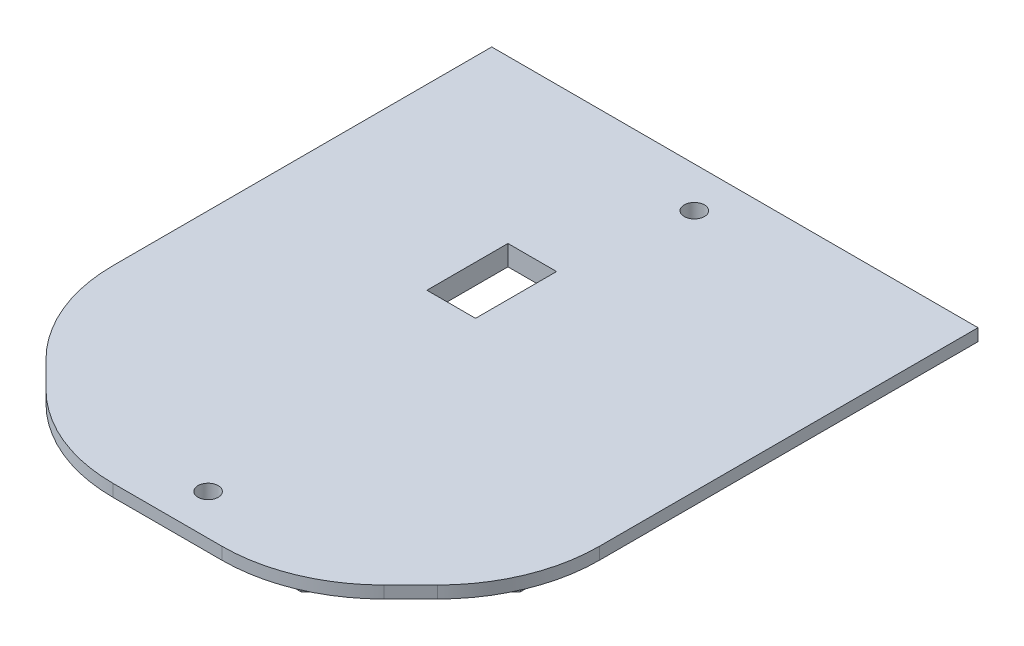
ISO-10303-21;
HEADER;
FILE_DESCRIPTION(('STEP AP214'),'2;1');
FILE_NAME('part.step','',(''),(''),'','','');
FILE_SCHEMA(('AUTOMOTIVE_DESIGN { 1 0 10303 214 1 1 1 1 }'));
ENDSEC;
DATA;
#1=APPLICATION_CONTEXT('core data for automotive mechanical design processes');
#2=APPLICATION_PROTOCOL_DEFINITION('international standard','automotive_design',2000,#1);
#3=PRODUCT_CONTEXT('',#1,'mechanical');
#4=PRODUCT('Part','Part','',(#3));
#5=PRODUCT_RELATED_PRODUCT_CATEGORY('part','',(#4));
#6=PRODUCT_DEFINITION_FORMATION('','',#4);
#7=PRODUCT_DEFINITION_CONTEXT('part definition',#1,'design');
#8=PRODUCT_DEFINITION('design','',#6,#7);
#9=PRODUCT_DEFINITION_SHAPE('','',#8);
#10=(LENGTH_UNIT() NAMED_UNIT(*) SI_UNIT(.MILLI.,.METRE.));
#11=(NAMED_UNIT(*) PLANE_ANGLE_UNIT() SI_UNIT($,.RADIAN.));
#12=(NAMED_UNIT(*) SI_UNIT($,.STERADIAN.) SOLID_ANGLE_UNIT());
#13=UNCERTAINTY_MEASURE_WITH_UNIT(LENGTH_MEASURE(1.E-05),#10,'distance_accuracy_value','');
#14=(GEOMETRIC_REPRESENTATION_CONTEXT(3) GLOBAL_UNCERTAINTY_ASSIGNED_CONTEXT((#13)) GLOBAL_UNIT_ASSIGNED_CONTEXT((#10,
#11,#12)) REPRESENTATION_CONTEXT('',''));
#15=CARTESIAN_POINT('',(0.,0.,0.));
#16=DIRECTION('',(0.,0.,1.));
#17=DIRECTION('',(1.,0.,0.));
#18=AXIS2_PLACEMENT_3D('',#15,#16,#17);
#19=CARTESIAN_POINT('',(0.,0.,0.));
#20=DIRECTION('',(0.,-1.,0.));
#21=DIRECTION('',(0.,0.,-1.));
#22=AXIS2_PLACEMENT_3D('',#19,#20,#21);
#23=PLANE('',#22);
#24=DIRECTION('',(0.,0.,-1.));
#25=VECTOR('',#24,1.);
#26=CARTESIAN_POINT('',(76.2,0.,50.7999999999999));
#27=LINE('',#26,#25);
#28=CARTESIAN_POINT('',(76.2,0.,29.7579510314467));
#29=VERTEX_POINT('',#28);
#30=CARTESIAN_POINT('',(76.2,0.,-88.9));
#31=VERTEX_POINT('',#30);
#32=EDGE_CURVE('E261',#29,#31,#27,.T.);
#33=ORIENTED_EDGE('',*,*,#32,.F.);
#34=CARTESIAN_POINT('',(25.4,0.,29.7579510314467));
#35=DIRECTION('',(0.,-1.,0.));
#36=DIRECTION('',(0.,0.,-1.));
#37=AXIS2_PLACEMENT_3D('',#34,#35,#36);
#38=CIRCLE('',#37,50.8);
#39=CARTESIAN_POINT('',(61.3210244842767,0.,65.6789755157233));
#40=VERTEX_POINT('',#39);
#41=EDGE_CURVE('E308',#29,#40,#38,.T.);
#42=ORIENTED_EDGE('',*,*,#41,.T.);
#43=DIRECTION('',(0.707106781186547,0.,-0.707106781186547));
#44=VECTOR('',#43,1.);
#45=CARTESIAN_POINT('',(38.1,0.,88.8999999999999));
#46=LINE('',#45,#44);
#47=CARTESIAN_POINT('',(52.9789755157234,0.,74.0210244842766));
#48=VERTEX_POINT('',#47);
#49=EDGE_CURVE('E265',#48,#40,#46,.T.);
#50=ORIENTED_EDGE('',*,*,#49,.F.);
#51=CARTESIAN_POINT('',(17.0579510314468,0.,38.0999999999999));
#52=DIRECTION('',(0.,-1.,0.));
#53=DIRECTION('',(0.,0.,-1.));
#54=AXIS2_PLACEMENT_3D('',#51,#52,#53);
#55=CIRCLE('',#54,50.8);
#56=CARTESIAN_POINT('',(17.0579510314468,0.,88.8999999999999));
#57=VERTEX_POINT('',#56);
#58=EDGE_CURVE('E306',#48,#57,#55,.T.);
#59=ORIENTED_EDGE('',*,*,#58,.T.);
#60=DIRECTION('',(1.,0.,0.));
#61=VECTOR('',#60,1.);
#62=CARTESIAN_POINT('',(-38.1,0.,88.8999999999999));
#63=LINE('',#62,#61);
#64=CARTESIAN_POINT('',(-17.0579510314468,0.,88.8999999999999));
#65=VERTEX_POINT('',#64);
#66=EDGE_CURVE('E289',#65,#57,#63,.T.);
#67=ORIENTED_EDGE('',*,*,#66,.F.);
#68=CARTESIAN_POINT('',(-17.0579510314468,0.,38.0999999999999));
#69=DIRECTION('',(0.,-1.,0.));
#70=DIRECTION('',(0.,0.,-1.));
#71=AXIS2_PLACEMENT_3D('',#68,#69,#70);
#72=CIRCLE('',#71,50.8);
#73=CARTESIAN_POINT('',(-52.9789755157234,0.,74.0210244842766));
#74=VERTEX_POINT('',#73);
#75=EDGE_CURVE('E304',#65,#74,#72,.T.);
#76=ORIENTED_EDGE('',*,*,#75,.T.);
#77=DIRECTION('',(0.707106781186547,0.,0.707106781186547));
#78=VECTOR('',#77,1.);
#79=CARTESIAN_POINT('',(-76.2,0.,50.7999999999999));
#80=LINE('',#79,#78);
#81=CARTESIAN_POINT('',(-61.3210244842766,0.,65.6789755157233));
#82=VERTEX_POINT('',#81);
#83=EDGE_CURVE('E286',#82,#74,#80,.T.);
#84=ORIENTED_EDGE('',*,*,#83,.F.);
#85=CARTESIAN_POINT('',(-25.4,0.,29.7579510314467));
#86=DIRECTION('',(0.,-1.,0.));
#87=DIRECTION('',(0.,0.,-1.));
#88=AXIS2_PLACEMENT_3D('',#85,#86,#87);
#89=CIRCLE('',#88,50.8);
#90=CARTESIAN_POINT('',(-76.2,0.,29.7579510314467));
#91=VERTEX_POINT('',#90);
#92=EDGE_CURVE('E302',#82,#91,#89,.T.);
#93=ORIENTED_EDGE('',*,*,#92,.T.);
#94=DIRECTION('',(0.,0.,1.));
#95=VECTOR('',#94,1.);
#96=CARTESIAN_POINT('',(-76.2,0.,50.7999999999999));
#97=LINE('',#96,#95);
#98=CARTESIAN_POINT('',(-76.2,0.,-88.9000000000001));
#99=VERTEX_POINT('',#98);
#100=EDGE_CURVE('E283',#99,#91,#97,.T.);
#101=ORIENTED_EDGE('',*,*,#100,.F.);
#102=DIRECTION('',(-1.,0.,0.));
#103=VECTOR('',#102,1.);
#104=CARTESIAN_POINT('',(-76.2,0.,-88.9000000000001));
#105=LINE('',#104,#103);
#106=EDGE_CURVE('E281',#31,#99,#105,.T.);
#107=ORIENTED_EDGE('',*,*,#106,.F.);
#108=EDGE_LOOP('',(#33,#42,#50,#59,#67,#76,#84,#93,#101,#107));
#109=FACE_BOUND('',#108,.T.);
#110=DIRECTION('',(0.,0.,-1.));
#111=VECTOR('',#110,1.);
#112=CARTESIAN_POINT('',(-69.85,0.,48.1697438789308));
#113=LINE('',#112,#111);
#114=CARTESIAN_POINT('',(-69.85,0.,48.1697438789308));
#115=VERTEX_POINT('',#114);
#116=CARTESIAN_POINT('',(-69.85,0.,-82.5500000000001));
#117=VERTEX_POINT('',#116);
#118=EDGE_CURVE('E230',#115,#117,#113,.T.);
#119=ORIENTED_EDGE('',*,*,#118,.F.);
#120=DIRECTION('',(-0.707106781186548,0.,-0.707106781186547));
#121=VECTOR('',#120,1.);
#122=CARTESIAN_POINT('',(-35.4697438789309,0.,82.5499999999999));
#123=LINE('',#122,#121);
#124=CARTESIAN_POINT('',(-35.4697438789309,0.,82.5499999999999));
#125=VERTEX_POINT('',#124);
#126=EDGE_CURVE('E212',#125,#115,#123,.T.);
#127=ORIENTED_EDGE('',*,*,#126,.F.);
#128=DIRECTION('',(-1.,0.,0.));
#129=VECTOR('',#128,1.);
#130=CARTESIAN_POINT('',(35.4697438789309,0.,82.5499999999999));
#131=LINE('',#130,#129);
#132=CARTESIAN_POINT('',(35.4697438789309,0.,82.5499999999999));
#133=VERTEX_POINT('',#132);
#134=EDGE_CURVE('E217',#133,#125,#131,.T.);
#135=ORIENTED_EDGE('',*,*,#134,.F.);
#136=DIRECTION('',(-0.707106781186547,0.,0.707106781186548));
#137=VECTOR('',#136,1.);
#138=CARTESIAN_POINT('',(69.85,0.,48.1697438789308));
#139=LINE('',#138,#137);
#140=CARTESIAN_POINT('',(69.85,0.,48.1697438789308));
#141=VERTEX_POINT('',#140);
#142=EDGE_CURVE('E236',#141,#133,#139,.T.);
#143=ORIENTED_EDGE('',*,*,#142,.F.);
#144=DIRECTION('',(0.,0.,1.));
#145=VECTOR('',#144,1.);
#146=CARTESIAN_POINT('',(69.85,0.,-82.5500000000001));
#147=LINE('',#146,#145);
#148=CARTESIAN_POINT('',(69.85,0.,-82.5500000000001));
#149=VERTEX_POINT('',#148);
#150=EDGE_CURVE('E234',#149,#141,#147,.T.);
#151=ORIENTED_EDGE('',*,*,#150,.F.);
#152=DIRECTION('',(1.,0.,0.));
#153=VECTOR('',#152,1.);
#154=CARTESIAN_POINT('',(-69.85,0.,-82.5500000000001));
#155=LINE('',#154,#153);
#156=EDGE_CURVE('E232',#117,#149,#155,.T.);
#157=ORIENTED_EDGE('',*,*,#156,.F.);
#158=EDGE_LOOP('',(#119,#127,#135,#143,#151,#157));
#159=FACE_BOUND('',#158,.T.);
#160=ADVANCED_FACE('F34',(#109,#159),#23,.T.);
#161=CARTESIAN_POINT('',(0.,3.81,0.));
#162=DIRECTION('',(0.,-1.,0.));
#163=DIRECTION('',(0.,0.,-1.));
#164=AXIS2_PLACEMENT_3D('',#161,#162,#163);
#165=PLANE('',#164);
#166=DIRECTION('',(-1.,0.,0.));
#167=VECTOR('',#166,1.);
#168=CARTESIAN_POINT('',(-20.32,3.81,-38.1000000000001));
#169=LINE('',#168,#167);
#170=CARTESIAN_POINT('',(-5.08000000000001,3.81,-38.1000000000001));
#171=VERTEX_POINT('',#170);
#172=CARTESIAN_POINT('',(-20.32,3.81,-38.1000000000001));
#173=VERTEX_POINT('',#172);
#174=EDGE_CURVE('E197',#171,#173,#169,.T.);
#175=ORIENTED_EDGE('',*,*,#174,.F.);
#176=DIRECTION('',(0.,0.,-1.));
#177=VECTOR('',#176,1.);
#178=CARTESIAN_POINT('',(-5.08000000000001,3.81,-38.1000000000001));
#179=LINE('',#178,#177);
#180=CARTESIAN_POINT('',(-5.08000000000001,3.81,-12.7000000000001));
#181=VERTEX_POINT('',#180);
#182=EDGE_CURVE('E49',#181,#171,#179,.T.);
#183=ORIENTED_EDGE('',*,*,#182,.F.);
#184=DIRECTION('',(1.,0.,0.));
#185=VECTOR('',#184,1.);
#186=CARTESIAN_POINT('',(-20.32,3.81,-12.7000000000001));
#187=LINE('',#186,#185);
#188=CARTESIAN_POINT('',(-20.32,3.81,-12.7000000000001));
#189=VERTEX_POINT('',#188);
#190=EDGE_CURVE('E188',#189,#181,#187,.T.);
#191=ORIENTED_EDGE('',*,*,#190,.F.);
#192=DIRECTION('',(0.,0.,1.));
#193=VECTOR('',#192,1.);
#194=CARTESIAN_POINT('',(-20.32,3.81,-38.1000000000001));
#195=LINE('',#194,#193);
#196=EDGE_CURVE('E191',#173,#189,#195,.T.);
#197=ORIENTED_EDGE('',*,*,#196,.F.);
#198=EDGE_LOOP('',(#175,#183,#191,#197));
#199=FACE_BOUND('',#198,.T.);
#200=DIRECTION('',(0.707106781186547,0.,-0.707106781186547));
#201=VECTOR('',#200,1.);
#202=CARTESIAN_POINT('',(38.1,3.81,88.8999999999999));
#203=LINE('',#202,#201);
#204=CARTESIAN_POINT('',(52.9789755157234,3.81,74.0210244842766));
#205=VERTEX_POINT('',#204);
#206=CARTESIAN_POINT('',(61.3210244842767,3.81,65.6789755157233));
#207=VERTEX_POINT('',#206);
#208=EDGE_CURVE('E276',#205,#207,#203,.T.);
#209=ORIENTED_EDGE('',*,*,#208,.T.);
#210=CARTESIAN_POINT('',(25.4,3.81,29.7579510314467));
#211=DIRECTION('',(0.,-1.,0.));
#212=DIRECTION('',(0.,0.,-1.));
#213=AXIS2_PLACEMENT_3D('',#210,#211,#212);
#214=CIRCLE('',#213,50.8);
#215=CARTESIAN_POINT('',(76.2,3.81,29.7579510314467));
#216=VERTEX_POINT('',#215);
#217=EDGE_CURVE('E321',#207,#216,#214,.F.);
#218=ORIENTED_EDGE('',*,*,#217,.T.);
#219=DIRECTION('',(0.,0.,-1.));
#220=VECTOR('',#219,1.);
#221=CARTESIAN_POINT('',(76.2,3.81,50.7999999999999));
#222=LINE('',#221,#220);
#223=CARTESIAN_POINT('',(76.2,3.81,-88.9));
#224=VERTEX_POINT('',#223);
#225=EDGE_CURVE('E262',#216,#224,#222,.T.);
#226=ORIENTED_EDGE('',*,*,#225,.T.);
#227=DIRECTION('',(-1.,0.,0.));
#228=VECTOR('',#227,1.);
#229=CARTESIAN_POINT('',(-76.2,3.81,-88.9000000000001));
#230=LINE('',#229,#228);
#231=CARTESIAN_POINT('',(-76.2,3.81,-88.9000000000001));
#232=VERTEX_POINT('',#231);
#233=EDGE_CURVE('E264',#224,#232,#230,.T.);
#234=ORIENTED_EDGE('',*,*,#233,.T.);
#235=DIRECTION('',(0.,0.,1.));
#236=VECTOR('',#235,1.);
#237=CARTESIAN_POINT('',(-76.2,3.81,50.7999999999999));
#238=LINE('',#237,#236);
#239=CARTESIAN_POINT('',(-76.2,3.81,29.7579510314467));
#240=VERTEX_POINT('',#239);
#241=EDGE_CURVE('E267',#232,#240,#238,.T.);
#242=ORIENTED_EDGE('',*,*,#241,.T.);
#243=CARTESIAN_POINT('',(-25.4,3.81,29.7579510314467));
#244=DIRECTION('',(0.,-1.,0.));
#245=DIRECTION('',(0.,0.,-1.));
#246=AXIS2_PLACEMENT_3D('',#243,#244,#245);
#247=CIRCLE('',#246,50.8);
#248=CARTESIAN_POINT('',(-61.3210244842766,3.81,65.6789755157233));
#249=VERTEX_POINT('',#248);
#250=EDGE_CURVE('E315',#240,#249,#247,.F.);
#251=ORIENTED_EDGE('',*,*,#250,.T.);
#252=DIRECTION('',(0.707106781186547,0.,0.707106781186547));
#253=VECTOR('',#252,1.);
#254=CARTESIAN_POINT('',(-76.2,3.81,50.7999999999999));
#255=LINE('',#254,#253);
#256=CARTESIAN_POINT('',(-52.9789755157234,3.81,74.0210244842766));
#257=VERTEX_POINT('',#256);
#258=EDGE_CURVE('E270',#249,#257,#255,.T.);
#259=ORIENTED_EDGE('',*,*,#258,.T.);
#260=CARTESIAN_POINT('',(-17.0579510314468,3.81,38.0999999999999));
#261=DIRECTION('',(0.,-1.,0.));
#262=DIRECTION('',(0.,0.,-1.));
#263=AXIS2_PLACEMENT_3D('',#260,#261,#262);
#264=CIRCLE('',#263,50.8);
#265=CARTESIAN_POINT('',(-17.0579510314468,3.81,88.8999999999999));
#266=VERTEX_POINT('',#265);
#267=EDGE_CURVE('E317',#257,#266,#264,.F.);
#268=ORIENTED_EDGE('',*,*,#267,.T.);
#269=DIRECTION('',(1.,0.,0.));
#270=VECTOR('',#269,1.);
#271=CARTESIAN_POINT('',(-38.1,3.81,88.8999999999999));
#272=LINE('',#271,#270);
#273=CARTESIAN_POINT('',(17.0579510314468,3.81,88.8999999999999));
#274=VERTEX_POINT('',#273);
#275=EDGE_CURVE('E273',#266,#274,#272,.T.);
#276=ORIENTED_EDGE('',*,*,#275,.T.);
#277=CARTESIAN_POINT('',(17.0579510314468,3.81,38.0999999999999));
#278=DIRECTION('',(0.,-1.,0.));
#279=DIRECTION('',(0.,0.,-1.));
#280=AXIS2_PLACEMENT_3D('',#277,#278,#279);
#281=CIRCLE('',#280,50.8);
#282=EDGE_CURVE('E319',#274,#205,#281,.F.);
#283=ORIENTED_EDGE('',*,*,#282,.T.);
#284=EDGE_LOOP('',(#209,#218,#226,#234,#242,#251,#259,#268,#276,#283));
#285=FACE_BOUND('',#284,.T.);
#286=CARTESIAN_POINT('',(0.,3.81,-76.2000000000001));
#287=DIRECTION('',(0.,1.,0.));
#288=DIRECTION('',(0.,0.,1.));
#289=AXIS2_PLACEMENT_3D('',#286,#287,#288);
#290=CIRCLE('',#289,3.175);
#291=CARTESIAN_POINT('',(0.,3.81,-73.0250000000001));
#292=VERTEX_POINT('',#291);
#293=EDGE_CURVE('E258',#292,#292,#290,.T.);
#294=ORIENTED_EDGE('',*,*,#293,.F.);
#295=EDGE_LOOP('',(#294));
#296=FACE_BOUND('',#295,.T.);
#297=CARTESIAN_POINT('',(0.,3.81,76.1999999999999));
#298=DIRECTION('',(0.,1.,0.));
#299=DIRECTION('',(0.,0.,1.));
#300=AXIS2_PLACEMENT_3D('',#297,#298,#299);
#301=CIRCLE('',#300,3.175);
#302=CARTESIAN_POINT('',(0.,3.81,79.3749999999999));
#303=VERTEX_POINT('',#302);
#304=EDGE_CURVE('E255',#303,#303,#301,.T.);
#305=ORIENTED_EDGE('',*,*,#304,.F.);
#306=EDGE_LOOP('',(#305));
#307=FACE_BOUND('',#306,.T.);
#308=ADVANCED_FACE('F339',(#199,#285,#296,#307),#165,.F.);
#309=CARTESIAN_POINT('',(76.2,3.81,50.7999999999999));
#310=DIRECTION('',(-1.,0.,0.));
#311=DIRECTION('',(0.,0.,1.));
#312=AXIS2_PLACEMENT_3D('',#309,#310,#311);
#313=PLANE('',#312);
#314=ORIENTED_EDGE('',*,*,#225,.F.);
#315=DIRECTION('',(0.,-1.,0.));
#316=VECTOR('',#315,1.);
#317=CARTESIAN_POINT('',(76.2,3.81,29.7579510314467));
#318=LINE('',#317,#316);
#319=EDGE_CURVE('E299',#216,#29,#318,.T.);
#320=ORIENTED_EDGE('',*,*,#319,.T.);
#321=ORIENTED_EDGE('',*,*,#32,.T.);
#322=DIRECTION('',(0.,-1.,0.));
#323=VECTOR('',#322,1.);
#324=CARTESIAN_POINT('',(76.2,3.81,-88.9));
#325=LINE('',#324,#323);
#326=EDGE_CURVE('E296',#224,#31,#325,.T.);
#327=ORIENTED_EDGE('',*,*,#326,.F.);
#328=EDGE_LOOP('',(#314,#320,#321,#327));
#329=FACE_BOUND('',#328,.T.);
#330=ADVANCED_FACE('F367',(#329),#313,.F.);
#331=CARTESIAN_POINT('',(-76.2,3.81,-88.9000000000001));
#332=DIRECTION('',(0.,0.,1.));
#333=DIRECTION('',(1.,0.,0.));
#334=AXIS2_PLACEMENT_3D('',#331,#332,#333);
#335=PLANE('',#334);
#336=ORIENTED_EDGE('',*,*,#106,.T.);
#337=DIRECTION('',(0.,-1.,0.));
#338=VECTOR('',#337,1.);
#339=CARTESIAN_POINT('',(-76.2,3.81,-88.9000000000001));
#340=LINE('',#339,#338);
#341=EDGE_CURVE('E279',#232,#99,#340,.T.);
#342=ORIENTED_EDGE('',*,*,#341,.F.);
#343=ORIENTED_EDGE('',*,*,#233,.F.);
#344=ORIENTED_EDGE('',*,*,#326,.T.);
#345=EDGE_LOOP('',(#336,#342,#343,#344));
#346=FACE_BOUND('',#345,.T.);
#347=ADVANCED_FACE('F374',(#346),#335,.F.);
#348=CARTESIAN_POINT('',(-76.2,3.81,50.7999999999999));
#349=DIRECTION('',(1.,0.,0.));
#350=DIRECTION('',(0.,0.,-1.));
#351=AXIS2_PLACEMENT_3D('',#348,#349,#350);
#352=PLANE('',#351);
#353=ORIENTED_EDGE('',*,*,#100,.T.);
#354=DIRECTION('',(0.,-1.,0.));
#355=VECTOR('',#354,1.);
#356=CARTESIAN_POINT('',(-76.2,3.81,29.7579510314467));
#357=LINE('',#356,#355);
#358=EDGE_CURVE('E11',#91,#240,#357,.F.);
#359=ORIENTED_EDGE('',*,*,#358,.T.);
#360=ORIENTED_EDGE('',*,*,#241,.F.);
#361=ORIENTED_EDGE('',*,*,#341,.T.);
#362=EDGE_LOOP('',(#353,#359,#360,#361));
#363=FACE_BOUND('',#362,.T.);
#364=ADVANCED_FACE('F379',(#363),#352,.F.);
#365=CARTESIAN_POINT('',(-76.2,3.81,50.7999999999999));
#366=DIRECTION('',(0.707106781186548,0.,-0.707106781186548));
#367=DIRECTION('',(-0.707106781186548,0.,-0.707106781186548));
#368=AXIS2_PLACEMENT_3D('',#365,#366,#367);
#369=PLANE('',#368);
#370=ORIENTED_EDGE('',*,*,#83,.T.);
#371=DIRECTION('',(0.,-1.,0.));
#372=VECTOR('',#371,1.);
#373=CARTESIAN_POINT('',(-52.9789755157234,3.81,74.0210244842766));
#374=LINE('',#373,#372);
#375=EDGE_CURVE('E42',#74,#257,#374,.F.);
#376=ORIENTED_EDGE('',*,*,#375,.T.);
#377=ORIENTED_EDGE('',*,*,#258,.F.);
#378=DIRECTION('',(0.,-1.,0.));
#379=VECTOR('',#378,1.);
#380=CARTESIAN_POINT('',(-61.3210244842766,3.81,65.6789755157233));
#381=LINE('',#380,#379);
#382=EDGE_CURVE('E328',#249,#82,#381,.T.);
#383=ORIENTED_EDGE('',*,*,#382,.T.);
#384=EDGE_LOOP('',(#370,#376,#377,#383));
#385=FACE_BOUND('',#384,.T.);
#386=ADVANCED_FACE('F333',(#385),#369,.F.);
#387=CARTESIAN_POINT('',(-38.1,3.81,88.8999999999999));
#388=DIRECTION('',(0.,0.,-1.));
#389=DIRECTION('',(-1.,0.,0.));
#390=AXIS2_PLACEMENT_3D('',#387,#388,#389);
#391=PLANE('',#390);
#392=ORIENTED_EDGE('',*,*,#66,.T.);
#393=DIRECTION('',(0.,-1.,0.));
#394=VECTOR('',#393,1.);
#395=CARTESIAN_POINT('',(17.0579510314468,3.81,88.8999999999999));
#396=LINE('',#395,#394);
#397=EDGE_CURVE('E326',#57,#274,#396,.F.);
#398=ORIENTED_EDGE('',*,*,#397,.T.);
#399=ORIENTED_EDGE('',*,*,#275,.F.);
#400=DIRECTION('',(0.,-1.,0.));
#401=VECTOR('',#400,1.);
#402=CARTESIAN_POINT('',(-17.0579510314468,3.81,88.8999999999999));
#403=LINE('',#402,#401);
#404=EDGE_CURVE('E323',#266,#65,#403,.T.);
#405=ORIENTED_EDGE('',*,*,#404,.T.);
#406=EDGE_LOOP('',(#392,#398,#399,#405));
#407=FACE_BOUND('',#406,.T.);
#408=ADVANCED_FACE('F347',(#407),#391,.F.);
#409=CARTESIAN_POINT('',(38.1,3.81,88.8999999999999));
#410=DIRECTION('',(-0.707106781186548,0.,-0.707106781186548));
#411=DIRECTION('',(-0.707106781186548,0.,0.707106781186548));
#412=AXIS2_PLACEMENT_3D('',#409,#410,#411);
#413=PLANE('',#412);
#414=ORIENTED_EDGE('',*,*,#49,.T.);
#415=DIRECTION('',(0.,-1.,0.));
#416=VECTOR('',#415,1.);
#417=CARTESIAN_POINT('',(61.3210244842767,3.81,65.6789755157233));
#418=LINE('',#417,#416);
#419=EDGE_CURVE('E313',#40,#207,#418,.F.);
#420=ORIENTED_EDGE('',*,*,#419,.T.);
#421=ORIENTED_EDGE('',*,*,#208,.F.);
#422=DIRECTION('',(0.,-1.,0.));
#423=VECTOR('',#422,1.);
#424=CARTESIAN_POINT('',(52.9789755157234,3.81,74.0210244842766));
#425=LINE('',#424,#423);
#426=EDGE_CURVE('E310',#205,#48,#425,.T.);
#427=ORIENTED_EDGE('',*,*,#426,.T.);
#428=EDGE_LOOP('',(#414,#420,#421,#427));
#429=FACE_BOUND('',#428,.T.);
#430=ADVANCED_FACE('F359',(#429),#413,.F.);
#431=CARTESIAN_POINT('',(0.,3.81,-76.2000000000001));
#432=DIRECTION('',(0.,-1.,0.));
#433=DIRECTION('',(0.,0.,-1.));
#434=AXIS2_PLACEMENT_3D('',#431,#432,#433);
#435=CYLINDRICAL_SURFACE('',#434,3.175);
#436=ORIENTED_EDGE('',*,*,#293,.T.);
#437=EDGE_LOOP('',(#436));
#438=FACE_BOUND('',#437,.T.);
#439=CARTESIAN_POINT('',(0.,-2.54,-76.2000000000001));
#440=DIRECTION('',(0.,-1.,0.));
#441=DIRECTION('',(0.,0.,-1.));
#442=AXIS2_PLACEMENT_3D('',#439,#440,#441);
#443=CIRCLE('',#442,3.175);
#444=CARTESIAN_POINT('',(0.,-2.54,-79.3750000000001));
#445=VERTEX_POINT('',#444);
#446=EDGE_CURVE('E203',#445,#445,#443,.T.);
#447=ORIENTED_EDGE('',*,*,#446,.T.);
#448=EDGE_LOOP('',(#447));
#449=FACE_BOUND('',#448,.T.);
#450=ADVANCED_FACE('F401',(#438,#449),#435,.F.);
#451=CARTESIAN_POINT('',(0.,3.81,76.1999999999999));
#452=DIRECTION('',(0.,-1.,0.));
#453=DIRECTION('',(0.,0.,-1.));
#454=AXIS2_PLACEMENT_3D('',#451,#452,#453);
#455=CYLINDRICAL_SURFACE('',#454,3.175);
#456=ORIENTED_EDGE('',*,*,#304,.T.);
#457=EDGE_LOOP('',(#456));
#458=FACE_BOUND('',#457,.T.);
#459=CARTESIAN_POINT('',(0.,-2.54,76.1999999999999));
#460=DIRECTION('',(0.,-1.,0.));
#461=DIRECTION('',(0.,0.,-1.));
#462=AXIS2_PLACEMENT_3D('',#459,#460,#461);
#463=CIRCLE('',#462,3.175);
#464=CARTESIAN_POINT('',(0.,-2.54,73.0249999999999));
#465=VERTEX_POINT('',#464);
#466=EDGE_CURVE('E209',#465,#465,#463,.T.);
#467=ORIENTED_EDGE('',*,*,#466,.T.);
#468=EDGE_LOOP('',(#467));
#469=FACE_BOUND('',#468,.T.);
#470=ADVANCED_FACE('F459',(#458,#469),#455,.F.);
#471=CARTESIAN_POINT('',(0.,-2.54,0.));
#472=DIRECTION('',(0.,1.,0.));
#473=DIRECTION('',(0.,0.,1.));
#474=AXIS2_PLACEMENT_3D('',#471,#472,#473);
#475=PLANE('',#474);
#476=DIRECTION('',(1.,0.,0.));
#477=VECTOR('',#476,1.);
#478=CARTESIAN_POINT('',(-20.32,-2.54,-12.7000000000001));
#479=LINE('',#478,#477);
#480=CARTESIAN_POINT('',(-20.32,-2.54,-12.7000000000001));
#481=VERTEX_POINT('',#480);
#482=CARTESIAN_POINT('',(-5.08000000000001,-2.54,-12.7000000000001));
#483=VERTEX_POINT('',#482);
#484=EDGE_CURVE('E178',#481,#483,#479,.T.);
#485=ORIENTED_EDGE('',*,*,#484,.T.);
#486=DIRECTION('',(0.,0.,-1.));
#487=VECTOR('',#486,1.);
#488=CARTESIAN_POINT('',(-5.08000000000001,-2.54,-38.1000000000001));
#489=LINE('',#488,#487);
#490=CARTESIAN_POINT('',(-5.08000000000001,-2.54,-38.1000000000001));
#491=VERTEX_POINT('',#490);
#492=EDGE_CURVE('E172',#483,#491,#489,.T.);
#493=ORIENTED_EDGE('',*,*,#492,.T.);
#494=DIRECTION('',(-1.,0.,0.));
#495=VECTOR('',#494,1.);
#496=CARTESIAN_POINT('',(-20.32,-2.54,-38.1000000000001));
#497=LINE('',#496,#495);
#498=CARTESIAN_POINT('',(-20.32,-2.54,-38.1000000000001));
#499=VERTEX_POINT('',#498);
#500=EDGE_CURVE('E181',#491,#499,#497,.T.);
#501=ORIENTED_EDGE('',*,*,#500,.T.);
#502=DIRECTION('',(0.,0.,1.));
#503=VECTOR('',#502,1.);
#504=CARTESIAN_POINT('',(-20.32,-2.54,-38.1000000000001));
#505=LINE('',#504,#503);
#506=EDGE_CURVE('E57',#499,#481,#505,.T.);
#507=ORIENTED_EDGE('',*,*,#506,.T.);
#508=EDGE_LOOP('',(#485,#493,#501,#507));
#509=FACE_BOUND('',#508,.T.);
#510=DIRECTION('',(-0.707106781186548,0.,-0.707106781186547));
#511=VECTOR('',#510,1.);
#512=CARTESIAN_POINT('',(-35.4697438789309,-2.54,82.5499999999999));
#513=LINE('',#512,#511);
#514=CARTESIAN_POINT('',(-35.4697438789309,-2.54,82.5499999999999));
#515=VERTEX_POINT('',#514);
#516=CARTESIAN_POINT('',(-69.85,-2.54,48.1697438789308));
#517=VERTEX_POINT('',#516);
#518=EDGE_CURVE('E213',#515,#517,#513,.T.);
#519=ORIENTED_EDGE('',*,*,#518,.T.);
#520=DIRECTION('',(0.,0.,-1.));
#521=VECTOR('',#520,1.);
#522=CARTESIAN_POINT('',(-69.85,-2.54,48.1697438789308));
#523=LINE('',#522,#521);
#524=CARTESIAN_POINT('',(-69.85,-2.54,-82.5500000000001));
#525=VERTEX_POINT('',#524);
#526=EDGE_CURVE('E216',#517,#525,#523,.T.);
#527=ORIENTED_EDGE('',*,*,#526,.T.);
#528=DIRECTION('',(1.,0.,0.));
#529=VECTOR('',#528,1.);
#530=CARTESIAN_POINT('',(-69.85,-2.54,-82.5500000000001));
#531=LINE('',#530,#529);
#532=CARTESIAN_POINT('',(69.85,-2.54,-82.5500000000001));
#533=VERTEX_POINT('',#532);
#534=EDGE_CURVE('E219',#525,#533,#531,.T.);
#535=ORIENTED_EDGE('',*,*,#534,.T.);
#536=DIRECTION('',(0.,0.,1.));
#537=VECTOR('',#536,1.);
#538=CARTESIAN_POINT('',(69.85,-2.54,-82.5500000000001));
#539=LINE('',#538,#537);
#540=CARTESIAN_POINT('',(69.85,-2.54,48.1697438789308));
#541=VERTEX_POINT('',#540);
#542=EDGE_CURVE('E221',#533,#541,#539,.T.);
#543=ORIENTED_EDGE('',*,*,#542,.T.);
#544=DIRECTION('',(-0.707106781186547,0.,0.707106781186548));
#545=VECTOR('',#544,1.);
#546=CARTESIAN_POINT('',(69.85,-2.54,48.1697438789308));
#547=LINE('',#546,#545);
#548=CARTESIAN_POINT('',(35.4697438789309,-2.54,82.5499999999999));
#549=VERTEX_POINT('',#548);
#550=EDGE_CURVE('E223',#541,#549,#547,.T.);
#551=ORIENTED_EDGE('',*,*,#550,.T.);
#552=DIRECTION('',(-1.,0.,0.));
#553=VECTOR('',#552,1.);
#554=CARTESIAN_POINT('',(35.4697438789309,-2.54,82.5499999999999));
#555=LINE('',#554,#553);
#556=EDGE_CURVE('E225',#549,#515,#555,.T.);
#557=ORIENTED_EDGE('',*,*,#556,.T.);
#558=EDGE_LOOP('',(#519,#527,#535,#543,#551,#557));
#559=FACE_BOUND('',#558,.T.);
#560=ORIENTED_EDGE('',*,*,#466,.F.);
#561=EDGE_LOOP('',(#560));
#562=FACE_BOUND('',#561,.T.);
#563=ORIENTED_EDGE('',*,*,#446,.F.);
#564=EDGE_LOOP('',(#563));
#565=FACE_BOUND('',#564,.T.);
#566=ADVANCED_FACE('F185',(#509,#559,#562,#565),#475,.F.);
#567=CARTESIAN_POINT('',(-35.4697438789309,-2.54,82.5499999999999));
#568=DIRECTION('',(0.707106781186547,0.,-0.707106781186548));
#569=DIRECTION('',(-0.707106781186548,0.,-0.707106781186547));
#570=AXIS2_PLACEMENT_3D('',#567,#568,#569);
#571=PLANE('',#570);
#572=ORIENTED_EDGE('',*,*,#126,.T.);
#573=DIRECTION('',(0.,1.,0.));
#574=VECTOR('',#573,1.);
#575=CARTESIAN_POINT('',(-69.85,-2.54,48.1697438789308));
#576=LINE('',#575,#574);
#577=EDGE_CURVE('E253',#517,#115,#576,.T.);
#578=ORIENTED_EDGE('',*,*,#577,.F.);
#579=ORIENTED_EDGE('',*,*,#518,.F.);
#580=DIRECTION('',(0.,1.,0.));
#581=VECTOR('',#580,1.);
#582=CARTESIAN_POINT('',(-35.4697438789309,-2.54,82.5499999999999));
#583=LINE('',#582,#581);
#584=EDGE_CURVE('E227',#515,#125,#583,.T.);
#585=ORIENTED_EDGE('',*,*,#584,.T.);
#586=EDGE_LOOP('',(#572,#578,#579,#585));
#587=FACE_BOUND('',#586,.T.);
#588=ADVANCED_FACE('F458',(#587),#571,.F.);
#589=CARTESIAN_POINT('',(-69.85,-2.54,48.1697438789308));
#590=DIRECTION('',(1.,0.,0.));
#591=DIRECTION('',(0.,0.,-1.));
#592=AXIS2_PLACEMENT_3D('',#589,#590,#591);
#593=PLANE('',#592);
#594=ORIENTED_EDGE('',*,*,#118,.T.);
#595=DIRECTION('',(0.,1.,0.));
#596=VECTOR('',#595,1.);
#597=CARTESIAN_POINT('',(-69.85,-2.54,-82.5500000000001));
#598=LINE('',#597,#596);
#599=EDGE_CURVE('E250',#525,#117,#598,.T.);
#600=ORIENTED_EDGE('',*,*,#599,.F.);
#601=ORIENTED_EDGE('',*,*,#526,.F.);
#602=ORIENTED_EDGE('',*,*,#577,.T.);
#603=EDGE_LOOP('',(#594,#600,#601,#602));
#604=FACE_BOUND('',#603,.T.);
#605=ADVANCED_FACE('F511',(#604),#593,.F.);
#606=CARTESIAN_POINT('',(-69.85,-2.54,-82.5500000000001));
#607=DIRECTION('',(0.,0.,1.));
#608=DIRECTION('',(1.,0.,0.));
#609=AXIS2_PLACEMENT_3D('',#606,#607,#608);
#610=PLANE('',#609);
#611=ORIENTED_EDGE('',*,*,#156,.T.);
#612=DIRECTION('',(0.,1.,0.));
#613=VECTOR('',#612,1.);
#614=CARTESIAN_POINT('',(69.85,-2.54,-82.5500000000001));
#615=LINE('',#614,#613);
#616=EDGE_CURVE('E247',#533,#149,#615,.T.);
#617=ORIENTED_EDGE('',*,*,#616,.F.);
#618=ORIENTED_EDGE('',*,*,#534,.F.);
#619=ORIENTED_EDGE('',*,*,#599,.T.);
#620=EDGE_LOOP('',(#611,#617,#618,#619));
#621=FACE_BOUND('',#620,.T.);
#622=ADVANCED_FACE('F507',(#621),#610,.F.);
#623=CARTESIAN_POINT('',(69.85,-2.54,-82.5500000000001));
#624=DIRECTION('',(-1.,0.,0.));
#625=DIRECTION('',(0.,0.,1.));
#626=AXIS2_PLACEMENT_3D('',#623,#624,#625);
#627=PLANE('',#626);
#628=ORIENTED_EDGE('',*,*,#150,.T.);
#629=DIRECTION('',(0.,1.,0.));
#630=VECTOR('',#629,1.);
#631=CARTESIAN_POINT('',(69.85,-2.54,48.1697438789308));
#632=LINE('',#631,#630);
#633=EDGE_CURVE('E244',#541,#141,#632,.T.);
#634=ORIENTED_EDGE('',*,*,#633,.F.);
#635=ORIENTED_EDGE('',*,*,#542,.F.);
#636=ORIENTED_EDGE('',*,*,#616,.T.);
#637=EDGE_LOOP('',(#628,#634,#635,#636));
#638=FACE_BOUND('',#637,.T.);
#639=ADVANCED_FACE('F503',(#638),#627,.F.);
#640=CARTESIAN_POINT('',(69.85,-2.54,48.1697438789308));
#641=DIRECTION('',(-0.707106781186548,0.,-0.707106781186547));
#642=DIRECTION('',(-0.707106781186547,0.,0.707106781186548));
#643=AXIS2_PLACEMENT_3D('',#640,#641,#642);
#644=PLANE('',#643);
#645=ORIENTED_EDGE('',*,*,#142,.T.);
#646=DIRECTION('',(0.,1.,0.));
#647=VECTOR('',#646,1.);
#648=CARTESIAN_POINT('',(35.4697438789309,-2.54,82.5499999999999));
#649=LINE('',#648,#647);
#650=EDGE_CURVE('E242',#549,#133,#649,.T.);
#651=ORIENTED_EDGE('',*,*,#650,.F.);
#652=ORIENTED_EDGE('',*,*,#550,.F.);
#653=ORIENTED_EDGE('',*,*,#633,.T.);
#654=EDGE_LOOP('',(#645,#651,#652,#653));
#655=FACE_BOUND('',#654,.T.);
#656=ADVANCED_FACE('F499',(#655),#644,.F.);
#657=CARTESIAN_POINT('',(35.4697438789309,-2.54,82.5499999999999));
#658=DIRECTION('',(0.,0.,-1.));
#659=DIRECTION('',(-1.,0.,0.));
#660=AXIS2_PLACEMENT_3D('',#657,#658,#659);
#661=PLANE('',#660);
#662=ORIENTED_EDGE('',*,*,#134,.T.);
#663=ORIENTED_EDGE('',*,*,#584,.F.);
#664=ORIENTED_EDGE('',*,*,#556,.F.);
#665=ORIENTED_EDGE('',*,*,#650,.T.);
#666=EDGE_LOOP('',(#662,#663,#664,#665));
#667=FACE_BOUND('',#666,.T.);
#668=ADVANCED_FACE('F419',(#667),#661,.F.);
#669=CARTESIAN_POINT('',(25.4,3.81,29.7579510314467));
#670=DIRECTION('',(0.,-1.,0.));
#671=DIRECTION('',(0.,0.,-1.));
#672=AXIS2_PLACEMENT_3D('',#669,#670,#671);
#673=CYLINDRICAL_SURFACE('',#672,50.8);
#674=ORIENTED_EDGE('',*,*,#217,.F.);
#675=ORIENTED_EDGE('',*,*,#419,.F.);
#676=ORIENTED_EDGE('',*,*,#41,.F.);
#677=ORIENTED_EDGE('',*,*,#319,.F.);
#678=EDGE_LOOP('',(#674,#675,#676,#677));
#679=FACE_BOUND('',#678,.T.);
#680=ADVANCED_FACE('F365',(#679),#673,.T.);
#681=CARTESIAN_POINT('',(17.0579510314468,3.81,38.0999999999999));
#682=DIRECTION('',(0.,-1.,0.));
#683=DIRECTION('',(0.,0.,-1.));
#684=AXIS2_PLACEMENT_3D('',#681,#682,#683);
#685=CYLINDRICAL_SURFACE('',#684,50.8);
#686=ORIENTED_EDGE('',*,*,#282,.F.);
#687=ORIENTED_EDGE('',*,*,#397,.F.);
#688=ORIENTED_EDGE('',*,*,#58,.F.);
#689=ORIENTED_EDGE('',*,*,#426,.F.);
#690=EDGE_LOOP('',(#686,#687,#688,#689));
#691=FACE_BOUND('',#690,.T.);
#692=ADVANCED_FACE('F356',(#691),#685,.T.);
#693=CARTESIAN_POINT('',(-17.0579510314468,3.81,38.0999999999999));
#694=DIRECTION('',(0.,-1.,0.));
#695=DIRECTION('',(0.,0.,-1.));
#696=AXIS2_PLACEMENT_3D('',#693,#694,#695);
#697=CYLINDRICAL_SURFACE('',#696,50.8);
#698=ORIENTED_EDGE('',*,*,#267,.F.);
#699=ORIENTED_EDGE('',*,*,#375,.F.);
#700=ORIENTED_EDGE('',*,*,#75,.F.);
#701=ORIENTED_EDGE('',*,*,#404,.F.);
#702=EDGE_LOOP('',(#698,#699,#700,#701));
#703=FACE_BOUND('',#702,.T.);
#704=ADVANCED_FACE('F344',(#703),#697,.T.);
#705=CARTESIAN_POINT('',(-25.4,3.81,29.7579510314467));
#706=DIRECTION('',(0.,-1.,0.));
#707=DIRECTION('',(0.,0.,-1.));
#708=AXIS2_PLACEMENT_3D('',#705,#706,#707);
#709=CYLINDRICAL_SURFACE('',#708,50.8);
#710=ORIENTED_EDGE('',*,*,#250,.F.);
#711=ORIENTED_EDGE('',*,*,#358,.F.);
#712=ORIENTED_EDGE('',*,*,#92,.F.);
#713=ORIENTED_EDGE('',*,*,#382,.F.);
#714=EDGE_LOOP('',(#710,#711,#712,#713));
#715=FACE_BOUND('',#714,.T.);
#716=ADVANCED_FACE('F36',(#715),#709,.T.);
#717=CARTESIAN_POINT('',(-5.08000000000001,-2.54,-38.1000000000001));
#718=DIRECTION('',(1.,0.,0.));
#719=DIRECTION('',(0.,0.,-1.));
#720=AXIS2_PLACEMENT_3D('',#717,#718,#719);
#721=PLANE('',#720);
#722=ORIENTED_EDGE('',*,*,#182,.T.);
#723=DIRECTION('',(0.,1.,0.));
#724=VECTOR('',#723,1.);
#725=CARTESIAN_POINT('',(-5.08000000000001,-2.54,-38.1000000000001));
#726=LINE('',#725,#724);
#727=EDGE_CURVE('E168',#491,#171,#726,.T.);
#728=ORIENTED_EDGE('',*,*,#727,.F.);
#729=ORIENTED_EDGE('',*,*,#492,.F.);
#730=DIRECTION('',(0.,1.,0.));
#731=VECTOR('',#730,1.);
#732=CARTESIAN_POINT('',(-5.08000000000001,-2.54,-12.7000000000001));
#733=LINE('',#732,#731);
#734=EDGE_CURVE('E201',#483,#181,#733,.T.);
#735=ORIENTED_EDGE('',*,*,#734,.T.);
#736=EDGE_LOOP('',(#722,#728,#729,#735));
#737=FACE_BOUND('',#736,.T.);
#738=ADVANCED_FACE('F170',(#737),#721,.F.);
#739=CARTESIAN_POINT('',(-20.32,-2.54,-12.7000000000001));
#740=DIRECTION('',(0.,0.,1.));
#741=DIRECTION('',(1.,0.,0.));
#742=AXIS2_PLACEMENT_3D('',#739,#740,#741);
#743=PLANE('',#742);
#744=ORIENTED_EDGE('',*,*,#190,.T.);
#745=ORIENTED_EDGE('',*,*,#734,.F.);
#746=ORIENTED_EDGE('',*,*,#484,.F.);
#747=DIRECTION('',(0.,1.,0.));
#748=VECTOR('',#747,1.);
#749=CARTESIAN_POINT('',(-20.32,-2.54,-12.7000000000001));
#750=LINE('',#749,#748);
#751=EDGE_CURVE('E204',#481,#189,#750,.T.);
#752=ORIENTED_EDGE('',*,*,#751,.T.);
#753=EDGE_LOOP('',(#744,#745,#746,#752));
#754=FACE_BOUND('',#753,.T.);
#755=ADVANCED_FACE('F467',(#754),#743,.F.);
#756=CARTESIAN_POINT('',(-20.32,-2.54,-38.1000000000001));
#757=DIRECTION('',(-1.,0.,0.));
#758=DIRECTION('',(0.,0.,1.));
#759=AXIS2_PLACEMENT_3D('',#756,#757,#758);
#760=PLANE('',#759);
#761=ORIENTED_EDGE('',*,*,#196,.T.);
#762=ORIENTED_EDGE('',*,*,#751,.F.);
#763=ORIENTED_EDGE('',*,*,#506,.F.);
#764=DIRECTION('',(0.,1.,0.));
#765=VECTOR('',#764,1.);
#766=CARTESIAN_POINT('',(-20.32,-2.54,-38.1000000000001));
#767=LINE('',#766,#765);
#768=EDGE_CURVE('E177',#499,#173,#767,.T.);
#769=ORIENTED_EDGE('',*,*,#768,.T.);
#770=EDGE_LOOP('',(#761,#762,#763,#769));
#771=FACE_BOUND('',#770,.T.);
#772=ADVANCED_FACE('F476',(#771),#760,.F.);
#773=CARTESIAN_POINT('',(-20.32,-2.54,-38.1000000000001));
#774=DIRECTION('',(0.,0.,-1.));
#775=DIRECTION('',(-1.,0.,0.));
#776=AXIS2_PLACEMENT_3D('',#773,#774,#775);
#777=PLANE('',#776);
#778=ORIENTED_EDGE('',*,*,#174,.T.);
#779=ORIENTED_EDGE('',*,*,#768,.F.);
#780=ORIENTED_EDGE('',*,*,#500,.F.);
#781=ORIENTED_EDGE('',*,*,#727,.T.);
#782=EDGE_LOOP('',(#778,#779,#780,#781));
#783=FACE_BOUND('',#782,.T.);
#784=ADVANCED_FACE('F182',(#783),#777,.F.);
#785=CLOSED_SHELL('',(#160,#308,#330,#347,#364,#386,#408,#430,#450,#470,#566,#588,#605,#622,
#639,#656,#668,#680,#692,#704,#716,#738,#755,#772,#784));
#786=MANIFOLD_SOLID_BREP('B2',#785);
#787=ADVANCED_BREP_SHAPE_REPRESENTATION('',(#18,#786),#14);
#788=SHAPE_DEFINITION_REPRESENTATION(#9,#787);
ENDSEC;
END-ISO-10303-21;
